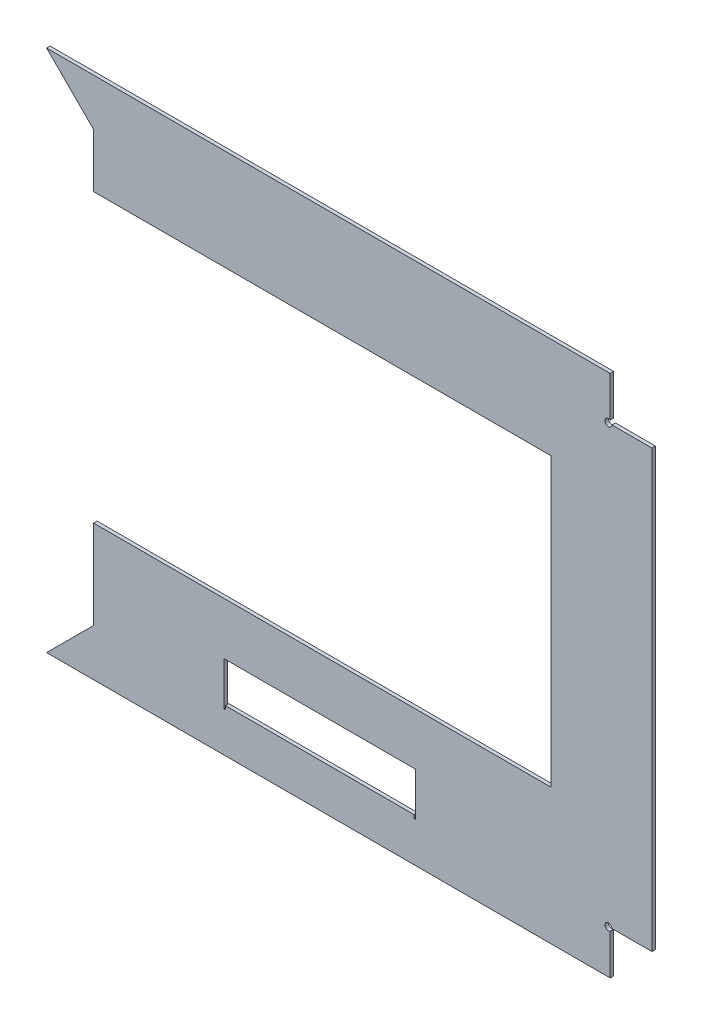
ISO-10303-21;
HEADER;
FILE_DESCRIPTION(('STEP AP214'),'2;1');
FILE_NAME('part.step','',(''),(''),'','','');
FILE_SCHEMA(('AUTOMOTIVE_DESIGN { 1 0 10303 214 1 1 1 1 }'));
ENDSEC;
DATA;
#1=APPLICATION_CONTEXT('core data for automotive mechanical design processes');
#2=APPLICATION_PROTOCOL_DEFINITION('international standard','automotive_design',2000,#1);
#3=PRODUCT_CONTEXT('',#1,'mechanical');
#4=PRODUCT('Part','Part','',(#3));
#5=PRODUCT_RELATED_PRODUCT_CATEGORY('part','',(#4));
#6=PRODUCT_DEFINITION_FORMATION('','',#4);
#7=PRODUCT_DEFINITION_CONTEXT('part definition',#1,'design');
#8=PRODUCT_DEFINITION('design','',#6,#7);
#9=PRODUCT_DEFINITION_SHAPE('','',#8);
#10=(LENGTH_UNIT() NAMED_UNIT(*) SI_UNIT(.MILLI.,.METRE.));
#11=(NAMED_UNIT(*) PLANE_ANGLE_UNIT() SI_UNIT($,.RADIAN.));
#12=(NAMED_UNIT(*) SI_UNIT($,.STERADIAN.) SOLID_ANGLE_UNIT());
#13=UNCERTAINTY_MEASURE_WITH_UNIT(LENGTH_MEASURE(1.E-05),#10,'distance_accuracy_value','');
#14=(GEOMETRIC_REPRESENTATION_CONTEXT(3) GLOBAL_UNCERTAINTY_ASSIGNED_CONTEXT((#13)) GLOBAL_UNIT_ASSIGNED_CONTEXT((#10,
#11,#12)) REPRESENTATION_CONTEXT('',''));
#15=CARTESIAN_POINT('',(0.,0.,0.));
#16=DIRECTION('',(0.,0.,1.));
#17=DIRECTION('',(1.,0.,0.));
#18=AXIS2_PLACEMENT_3D('',#15,#16,#17);
#19=CARTESIAN_POINT('',(649.998494896039,-105.7,2.22044604925031E-13));
#20=DIRECTION('',(0.,1.,0.));
#21=DIRECTION('',(-1.,0.,0.));
#22=AXIS2_PLACEMENT_3D('',#19,#20,#21);
#23=PLANE('',#22);
#24=DIRECTION('',(0.,0.,1.));
#25=VECTOR('',#24,1.);
#26=CARTESIAN_POINT('',(649.987283445268,-105.7,-4.01999999999969));
#27=LINE('',#26,#25);
#28=CARTESIAN_POINT('',(649.987283445268,-105.7,-3.99999999999985));
#29=VERTEX_POINT('',#28);
#30=CARTESIAN_POINT('',(649.987283445268,-105.7,1.50939503766362E-13));
#31=VERTEX_POINT('',#30);
#32=EDGE_CURVE('E383',#29,#31,#27,.T.);
#33=ORIENTED_EDGE('',*,*,#32,.F.);
#34=DIRECTION('',(1.,0.,0.));
#35=VECTOR('',#34,1.);
#36=CARTESIAN_POINT('',(649.998494896039,-105.7,-3.99999999999978));
#37=LINE('',#36,#35);
#38=CARTESIAN_POINT('',(695.99849489604,-105.7,-4.00000000000023));
#39=VERTEX_POINT('',#38);
#40=EDGE_CURVE('E382',#29,#39,#37,.T.);
#41=ORIENTED_EDGE('',*,*,#40,.T.);
#42=DIRECTION('',(0.,0.,-1.));
#43=VECTOR('',#42,1.);
#44=CARTESIAN_POINT('',(695.99849489604,-105.7,-2.22044604925031E-13));
#45=LINE('',#44,#43);
#46=CARTESIAN_POINT('',(695.99849489604,-105.7,-2.22044604925031E-13));
#47=VERTEX_POINT('',#46);
#48=EDGE_CURVE('E468',#47,#39,#45,.T.);
#49=ORIENTED_EDGE('',*,*,#48,.F.);
#50=DIRECTION('',(1.,0.,0.));
#51=VECTOR('',#50,1.);
#52=CARTESIAN_POINT('',(649.998494896039,-105.7,2.22044604925031E-13));
#53=LINE('',#52,#51);
#54=EDGE_CURVE('E200',#31,#47,#53,.T.);
#55=ORIENTED_EDGE('',*,*,#54,.F.);
#56=EDGE_LOOP('',(#33,#41,#49,#55));
#57=FACE_BOUND('',#56,.T.);
#58=ADVANCED_FACE('F196',(#57),#23,.F.);
#59=CARTESIAN_POINT('',(648.,-109.99849489604,-3.99999999999998));
#60=DIRECTION('',(-1.,0.,0.));
#61=DIRECTION('',(0.,-1.,0.));
#62=AXIS2_PLACEMENT_3D('',#59,#60,#61);
#63=PLANE('',#62);
#64=DIRECTION('',(0.,0.,1.));
#65=VECTOR('',#64,1.);
#66=CARTESIAN_POINT('',(648.,-109.46204535957,-4.01999999999969));
#67=LINE('',#66,#65);
#68=CARTESIAN_POINT('',(648.,-109.46204535957,0.));
#69=VERTEX_POINT('',#68);
#70=CARTESIAN_POINT('',(648.,-109.46204535957,-4.00000000000025));
#71=VERTEX_POINT('',#70);
#72=EDGE_CURVE('E14',#69,#71,#67,.F.);
#73=ORIENTED_EDGE('',*,*,#72,.F.);
#74=DIRECTION('',(0.,-1.,0.));
#75=VECTOR('',#74,1.);
#76=CARTESIAN_POINT('',(648.,-109.99849489604,0.));
#77=LINE('',#76,#75);
#78=CARTESIAN_POINT('',(648.,-155.99849489604,-2.4980018054066E-13));
#79=VERTEX_POINT('',#78);
#80=EDGE_CURVE('E399',#69,#79,#77,.T.);
#81=ORIENTED_EDGE('',*,*,#80,.T.);
#82=DIRECTION('',(0.,0.,1.));
#83=VECTOR('',#82,1.);
#84=CARTESIAN_POINT('',(648.,-155.99849489604,-4.00000000000025));
#85=LINE('',#84,#83);
#86=CARTESIAN_POINT('',(648.,-155.99849489604,-4.00000000000025));
#87=VERTEX_POINT('',#86);
#88=EDGE_CURVE('E388',#87,#79,#85,.T.);
#89=ORIENTED_EDGE('',*,*,#88,.F.);
#90=DIRECTION('',(0.,-1.,0.));
#91=VECTOR('',#90,1.);
#92=CARTESIAN_POINT('',(648.,-109.99849489604,-3.99999999999998));
#93=LINE('',#92,#91);
#94=EDGE_CURVE('E379',#71,#87,#93,.T.);
#95=ORIENTED_EDGE('',*,*,#94,.F.);
#96=EDGE_LOOP('',(#73,#81,#89,#95));
#97=FACE_BOUND('',#96,.T.);
#98=ADVANCED_FACE('F386',(#97),#63,.F.);
#99=CARTESIAN_POINT('',(649.99849489604,395.7,2.22044604925031E-13));
#100=DIRECTION('',(0.,1.,0.));
#101=DIRECTION('',(1.,0.,0.));
#102=AXIS2_PLACEMENT_3D('',#99,#100,#101);
#103=PLANE('',#102);
#104=DIRECTION('',(1.,0.,0.));
#105=VECTOR('',#104,1.);
#106=CARTESIAN_POINT('',(649.99849489604,395.7,-3.99999999999978));
#107=LINE('',#106,#105);
#108=CARTESIAN_POINT('',(649.987283445268,395.7,-3.99999999999985));
#109=VERTEX_POINT('',#108);
#110=CARTESIAN_POINT('',(695.998494896039,395.7,-4.00000000000011));
#111=VERTEX_POINT('',#110);
#112=EDGE_CURVE('E466',#109,#111,#107,.T.);
#113=ORIENTED_EDGE('',*,*,#112,.F.);
#114=DIRECTION('',(0.,0.,1.));
#115=VECTOR('',#114,1.);
#116=CARTESIAN_POINT('',(649.987283445268,395.7,-4.01999999999984));
#117=LINE('',#116,#115);
#118=CARTESIAN_POINT('',(649.987283445268,395.7,1.51535528106944E-13));
#119=VERTEX_POINT('',#118);
#120=EDGE_CURVE('E557',#109,#119,#117,.T.);
#121=ORIENTED_EDGE('',*,*,#120,.T.);
#122=DIRECTION('',(1.,0.,0.));
#123=VECTOR('',#122,1.);
#124=CARTESIAN_POINT('',(649.99849489604,395.7,2.22044604925031E-13));
#125=LINE('',#124,#123);
#126=CARTESIAN_POINT('',(695.99849489604,395.7,-1.11022302462516E-13));
#127=VERTEX_POINT('',#126);
#128=EDGE_CURVE('E456',#119,#127,#125,.T.);
#129=ORIENTED_EDGE('',*,*,#128,.T.);
#130=DIRECTION('',(0.,0.,-1.));
#131=VECTOR('',#130,1.);
#132=CARTESIAN_POINT('',(695.99849489604,395.7,-1.11022302462516E-13));
#133=LINE('',#132,#131);
#134=EDGE_CURVE('E450',#127,#111,#133,.T.);
#135=ORIENTED_EDGE('',*,*,#134,.T.);
#136=EDGE_LOOP('',(#113,#121,#129,#135));
#137=FACE_BOUND('',#136,.T.);
#138=ADVANCED_FACE('F642',(#137),#103,.T.);
#139=CARTESIAN_POINT('',(648.,399.99849489604,-3.99999999999984));
#140=DIRECTION('',(1.,0.,0.));
#141=DIRECTION('',(0.,-1.,0.));
#142=AXIS2_PLACEMENT_3D('',#139,#140,#141);
#143=PLANE('',#142);
#144=DIRECTION('',(0.,1.,0.));
#145=VECTOR('',#144,1.);
#146=CARTESIAN_POINT('',(648.,399.99849489604,1.66533453693773E-13));
#147=LINE('',#146,#145);
#148=CARTESIAN_POINT('',(648.,399.46204535957,1.64798730217797E-13));
#149=VERTEX_POINT('',#148);
#150=CARTESIAN_POINT('',(648.,445.99849489604,-2.22044604925031E-13));
#151=VERTEX_POINT('',#150);
#152=EDGE_CURVE('E533',#149,#151,#147,.T.);
#153=ORIENTED_EDGE('',*,*,#152,.F.);
#154=DIRECTION('',(0.,0.,1.));
#155=VECTOR('',#154,1.);
#156=CARTESIAN_POINT('',(648.,399.46204535957,-4.01999999999984));
#157=LINE('',#156,#155);
#158=CARTESIAN_POINT('',(648.,399.46204535957,-3.99999999999983));
#159=VERTEX_POINT('',#158);
#160=EDGE_CURVE('E206',#149,#159,#157,.F.);
#161=ORIENTED_EDGE('',*,*,#160,.T.);
#162=DIRECTION('',(0.,1.,0.));
#163=VECTOR('',#162,1.);
#164=CARTESIAN_POINT('',(648.,399.99849489604,-3.99999999999984));
#165=LINE('',#164,#163);
#166=CARTESIAN_POINT('',(648.,445.99849489604,-4.00000000000023));
#167=VERTEX_POINT('',#166);
#168=EDGE_CURVE('E535',#159,#167,#165,.T.);
#169=ORIENTED_EDGE('',*,*,#168,.T.);
#170=DIRECTION('',(0.,0.,1.));
#171=VECTOR('',#170,1.);
#172=CARTESIAN_POINT('',(648.,445.99849489604,-4.00000000000023));
#173=LINE('',#172,#171);
#174=EDGE_CURVE('E563',#167,#151,#173,.T.);
#175=ORIENTED_EDGE('',*,*,#174,.T.);
#176=EDGE_LOOP('',(#153,#161,#169,#175));
#177=FACE_BOUND('',#176,.T.);
#178=ADVANCED_FACE('F647',(#177),#143,.T.);
#179=CARTESIAN_POINT('',(424.000000000004,-59.9999999999999,4.00000000000018));
#180=DIRECTION('',(1.,0.,0.));
#181=DIRECTION('',(0.,0.,-1.));
#182=AXIS2_PLACEMENT_3D('',#179,#180,#181);
#183=PLANE('',#182);
#184=DIRECTION('',(0.,-1.,0.));
#185=VECTOR('',#184,1.);
#186=CARTESIAN_POINT('',(424.000000000004,-59.9999999999999,-3.99999999999982));
#187=LINE('',#186,#185);
#188=CARTESIAN_POINT('',(424.000000000004,-59.9999999999999,-3.99999999999982));
#189=VERTEX_POINT('',#188);
#190=CARTESIAN_POINT('',(424.000000000004,-109.99849489604,-3.99999999999991));
#191=VERTEX_POINT('',#190);
#192=EDGE_CURVE('E445',#189,#191,#187,.T.);
#193=ORIENTED_EDGE('',*,*,#192,.T.);
#194=DIRECTION('',(0.,0.,-1.));
#195=VECTOR('',#194,1.);
#196=CARTESIAN_POINT('',(424.000000000004,-109.99849489604,46.0000000000002));
#197=LINE('',#196,#195);
#198=CARTESIAN_POINT('',(424.000000000004,-109.99849489604,0.));
#199=VERTEX_POINT('',#198);
#200=EDGE_CURVE('E441',#199,#191,#197,.T.);
#201=ORIENTED_EDGE('',*,*,#200,.F.);
#202=DIRECTION('',(0.,-1.,0.));
#203=VECTOR('',#202,1.);
#204=CARTESIAN_POINT('',(424.000000000004,0.,1.80411241501588E-13));
#205=LINE('',#204,#203);
#206=CARTESIAN_POINT('',(424.000000000004,-59.9999999999999,1.80411241501588E-13));
#207=VERTEX_POINT('',#206);
#208=EDGE_CURVE('E487',#207,#199,#205,.T.);
#209=ORIENTED_EDGE('',*,*,#208,.F.);
#210=DIRECTION('',(0.,0.,-1.));
#211=VECTOR('',#210,1.);
#212=CARTESIAN_POINT('',(424.000000000004,-59.9999999999999,4.00000000000018));
#213=LINE('',#212,#211);
#214=EDGE_CURVE('E481',#207,#189,#213,.T.);
#215=ORIENTED_EDGE('',*,*,#214,.T.);
#216=EDGE_LOOP('',(#193,#201,#209,#215));
#217=FACE_BOUND('',#216,.T.);
#218=ADVANCED_FACE('F620',(#217),#183,.F.);
#219=CARTESIAN_POINT('',(0.,0.,-3.99999999999982));
#220=DIRECTION('',(0.,0.,-1.));
#221=DIRECTION('',(-1.,0.,0.));
#222=AXIS2_PLACEMENT_3D('',#219,#220,#221);
#223=PLANE('',#222);
#224=DIRECTION('',(-1.,0.,0.));
#225=VECTOR('',#224,1.);
#226=CARTESIAN_POINT('',(424.000000000004,-109.99849489604,-3.99999999999984));
#227=LINE('',#226,#225);
#228=CARTESIAN_POINT('',(422.500000000004,-109.99849489604,-3.99999999999984));
#229=VERTEX_POINT('',#228);
#230=EDGE_CURVE('E569',#191,#229,#227,.T.);
#231=ORIENTED_EDGE('',*,*,#230,.F.);
#232=ORIENTED_EDGE('',*,*,#192,.F.);
#233=DIRECTION('',(1.,0.,0.));
#234=VECTOR('',#233,1.);
#235=CARTESIAN_POINT('',(424.000000000004,-59.9999999999999,-3.99999999999982));
#236=LINE('',#235,#234);
#237=CARTESIAN_POINT('',(204.000000000004,-59.9999999999999,-3.99999999999982));
#238=VERTEX_POINT('',#237);
#239=EDGE_CURVE('E477',#238,#189,#236,.T.);
#240=ORIENTED_EDGE('',*,*,#239,.F.);
#241=DIRECTION('',(0.,1.,0.));
#242=VECTOR('',#241,1.);
#243=CARTESIAN_POINT('',(204.000000000004,-59.9999999999999,-3.99999999999982));
#244=LINE('',#243,#242);
#245=CARTESIAN_POINT('',(204.000000000004,-109.99849489604,-3.99999999999988));
#246=VERTEX_POINT('',#245);
#247=EDGE_CURVE('E448',#246,#238,#244,.T.);
#248=ORIENTED_EDGE('',*,*,#247,.F.);
#249=CARTESIAN_POINT('',(205.500000000004,-109.99849489604,-3.99999999999984));
#250=VERTEX_POINT('',#249);
#251=EDGE_CURVE('E574',#250,#246,#227,.T.);
#252=ORIENTED_EDGE('',*,*,#251,.F.);
#253=DIRECTION('',(0.,-1.,0.));
#254=VECTOR('',#253,1.);
#255=CARTESIAN_POINT('',(205.500000000004,-105.99849489604,-3.99999999999989));
#256=LINE('',#255,#254);
#257=CARTESIAN_POINT('',(205.500000000004,-105.99849489604,-3.99999999999989));
#258=VERTEX_POINT('',#257);
#259=EDGE_CURVE('E406',#258,#250,#256,.T.);
#260=ORIENTED_EDGE('',*,*,#259,.F.);
#261=DIRECTION('',(-1.,0.,0.));
#262=VECTOR('',#261,1.);
#263=CARTESIAN_POINT('',(422.500000000004,-105.99849489604,-3.99999999999989));
#264=LINE('',#263,#262);
#265=CARTESIAN_POINT('',(422.500000000004,-105.99849489604,-3.99999999999989));
#266=VERTEX_POINT('',#265);
#267=EDGE_CURVE('E416',#266,#258,#264,.T.);
#268=ORIENTED_EDGE('',*,*,#267,.F.);
#269=DIRECTION('',(0.,-1.,0.));
#270=VECTOR('',#269,1.);
#271=CARTESIAN_POINT('',(422.500000000004,-105.99849489604,-3.99999999999989));
#272=LINE('',#271,#270);
#273=EDGE_CURVE('E390',#266,#229,#272,.T.);
#274=ORIENTED_EDGE('',*,*,#273,.T.);
#275=EDGE_LOOP('',(#231,#232,#240,#248,#252,#260,#268,#274));
#276=FACE_BOUND('',#275,.T.);
#277=ORIENTED_EDGE('',*,*,#40,.F.);
#278=CARTESIAN_POINT('',(645.99924744802,-105.99924744802,-3.99999999999982));
#279=DIRECTION('',(0.,0.,-1.));
#280=DIRECTION('',(-1.,0.,0.));
#281=AXIS2_PLACEMENT_3D('',#278,#279,#280);
#282=CIRCLE('',#281,3.99924744801982);
#283=EDGE_CURVE('E370',#29,#71,#282,.F.);
#284=ORIENTED_EDGE('',*,*,#283,.T.);
#285=ORIENTED_EDGE('',*,*,#94,.T.);
#286=DIRECTION('',(-1.,0.,0.));
#287=VECTOR('',#286,1.);
#288=CARTESIAN_POINT('',(0.,-155.99849489604,-4.00000000000036));
#289=LINE('',#288,#287);
#290=CARTESIAN_POINT('',(0.,-155.998494896044,-4.00000000000036));
#291=VERTEX_POINT('',#290);
#292=EDGE_CURVE('E389',#87,#291,#289,.T.);
#293=ORIENTED_EDGE('',*,*,#292,.T.);
#294=DIRECTION('',(0.707106781186544,0.707106781186551,0.));
#295=VECTOR('',#294,1.);
#296=CARTESIAN_POINT('',(25.0000000000024,-130.998494896041,-4.00000000000013));
#297=LINE('',#296,#295);
#298=CARTESIAN_POINT('',(46.0000000000038,-109.99849489604,-3.99999999999998));
#299=VERTEX_POINT('',#298);
#300=EDGE_CURVE('E395',#291,#299,#297,.T.);
#301=ORIENTED_EDGE('',*,*,#300,.T.);
#302=DIRECTION('',(0.707173301140883,0.707040254973864,0.));
#303=VECTOR('',#302,1.);
#304=CARTESIAN_POINT('',(46.0000000000036,-109.99849489604,-3.99999999999988));
#305=LINE('',#304,#303);
#306=CARTESIAN_POINT('',(54.0000000000037,-102.,-3.99999999999988));
#307=VERTEX_POINT('',#306);
#308=EDGE_CURVE('E435',#299,#307,#305,.T.);
#309=ORIENTED_EDGE('',*,*,#308,.T.);
#310=DIRECTION('',(0.,1.,0.));
#311=VECTOR('',#310,1.);
#312=CARTESIAN_POINT('',(53.9999999999994,-110.010025,-3.99999999999568));
#313=LINE('',#312,#311);
#314=CARTESIAN_POINT('',(53.9999999999994,0.,-3.99999999999605));
#315=VERTEX_POINT('',#314);
#316=EDGE_CURVE('E494',#307,#315,#313,.T.);
#317=ORIENTED_EDGE('',*,*,#316,.T.);
#318=DIRECTION('',(-1.,0.,0.));
#319=VECTOR('',#318,1.);
#320=CARTESIAN_POINT('',(0.,0.,-3.99999999999982));
#321=LINE('',#320,#319);
#322=CARTESIAN_POINT('',(580.,0.,-3.99999999999982));
#323=VERTEX_POINT('',#322);
#324=EDGE_CURVE('E510',#323,#315,#321,.T.);
#325=ORIENTED_EDGE('',*,*,#324,.F.);
#326=DIRECTION('',(0.,-1.,0.));
#327=VECTOR('',#326,1.);
#328=CARTESIAN_POINT('',(580.,0.,-3.99999999999982));
#329=LINE('',#328,#327);
#330=CARTESIAN_POINT('',(580.,330.,-3.99999999999982));
#331=VERTEX_POINT('',#330);
#332=EDGE_CURVE('E506',#331,#323,#329,.T.);
#333=ORIENTED_EDGE('',*,*,#332,.F.);
#334=DIRECTION('',(1.,0.,0.));
#335=VECTOR('',#334,1.);
#336=CARTESIAN_POINT('',(580.,330.,-3.99999999999982));
#337=LINE('',#336,#335);
#338=CARTESIAN_POINT('',(53.9999999999994,330.,-3.99999999999715));
#339=VERTEX_POINT('',#338);
#340=EDGE_CURVE('E504',#339,#331,#337,.T.);
#341=ORIENTED_EDGE('',*,*,#340,.F.);
#342=DIRECTION('',(0.,1.,0.));
#343=VECTOR('',#342,1.);
#344=CARTESIAN_POINT('',(53.9999999999994,-110.010025,-3.99999999999568));
#345=LINE('',#344,#343);
#346=CARTESIAN_POINT('',(54.0000000000017,392.,-3.9999999999998));
#347=VERTEX_POINT('',#346);
#348=EDGE_CURVE('E492',#339,#347,#345,.T.);
#349=ORIENTED_EDGE('',*,*,#348,.T.);
#350=DIRECTION('',(-0.707173301140879,0.707040254973868,0.));
#351=VECTOR('',#350,1.);
#352=CARTESIAN_POINT('',(54.0000000000017,392.,-3.99999999999984));
#353=LINE('',#352,#351);
#354=CARTESIAN_POINT('',(46.0000000000019,399.99849489604,-3.99999999999984));
#355=VERTEX_POINT('',#354);
#356=EDGE_CURVE('E434',#347,#355,#353,.T.);
#357=ORIENTED_EDGE('',*,*,#356,.T.);
#358=DIRECTION('',(0.707106781186544,-0.707106781186551,0.));
#359=VECTOR('',#358,1.);
#360=CARTESIAN_POINT('',(0.,445.998494896042,-4.00000000000017));
#361=LINE('',#360,#359);
#362=CARTESIAN_POINT('',(0.,445.998494896042,-4.00000000000017));
#363=VERTEX_POINT('',#362);
#364=EDGE_CURVE('E546',#363,#355,#361,.T.);
#365=ORIENTED_EDGE('',*,*,#364,.F.);
#366=DIRECTION('',(1.,0.,0.));
#367=VECTOR('',#366,1.);
#368=CARTESIAN_POINT('',(0.,445.99849489604,-4.00000000000023));
#369=LINE('',#368,#367);
#370=EDGE_CURVE('E548',#363,#167,#369,.T.);
#371=ORIENTED_EDGE('',*,*,#370,.T.);
#372=ORIENTED_EDGE('',*,*,#168,.F.);
#373=CARTESIAN_POINT('',(645.99924744802,395.99924744802,-3.99999999999982));
#374=DIRECTION('',(0.,0.,-1.));
#375=DIRECTION('',(-1.,0.,0.));
#376=AXIS2_PLACEMENT_3D('',#373,#374,#375);
#377=CIRCLE('',#376,3.99924744801982);
#378=EDGE_CURVE('E221',#159,#109,#377,.F.);
#379=ORIENTED_EDGE('',*,*,#378,.T.);
#380=ORIENTED_EDGE('',*,*,#112,.T.);
#381=DIRECTION('',(0.,-1.,0.));
#382=VECTOR('',#381,1.);
#383=CARTESIAN_POINT('',(695.99849489604,0.,-4.));
#384=LINE('',#383,#382);
#385=EDGE_CURVE('E460',#111,#39,#384,.T.);
#386=ORIENTED_EDGE('',*,*,#385,.T.);
#387=EDGE_LOOP('',(#277,#284,#285,#293,#301,#309,#317,#325,#333,#341,#349,#357,#365,#371,#372,
#379,#380,#386));
#388=FACE_BOUND('',#387,.T.);
#389=ADVANCED_FACE('F377',(#276,#388),#223,.T.);
#390=CARTESIAN_POINT('',(0.,0.,1.80411241501588E-13));
#391=DIRECTION('',(0.,0.,-1.));
#392=DIRECTION('',(-1.,0.,0.));
#393=AXIS2_PLACEMENT_3D('',#390,#391,#392);
#394=PLANE('',#393);
#395=CARTESIAN_POINT('',(645.99924744802,-105.99924744802,1.80411241501588E-13));
#396=DIRECTION('',(0.,0.,-1.));
#397=DIRECTION('',(-1.,0.,0.));
#398=AXIS2_PLACEMENT_3D('',#395,#396,#397);
#399=CIRCLE('',#398,3.99924744801982);
#400=EDGE_CURVE('E213',#31,#69,#399,.F.);
#401=ORIENTED_EDGE('',*,*,#400,.F.);
#402=ORIENTED_EDGE('',*,*,#54,.T.);
#403=DIRECTION('',(0.,1.,0.));
#404=VECTOR('',#403,1.);
#405=CARTESIAN_POINT('',(695.99849489604,-110.,-1.11022302462516E-13));
#406=LINE('',#405,#404);
#407=EDGE_CURVE('E438',#127,#47,#406,.F.);
#408=ORIENTED_EDGE('',*,*,#407,.F.);
#409=ORIENTED_EDGE('',*,*,#128,.F.);
#410=CARTESIAN_POINT('',(645.99924744802,395.99924744802,1.80411241501588E-13));
#411=DIRECTION('',(0.,0.,-1.));
#412=DIRECTION('',(-1.,0.,0.));
#413=AXIS2_PLACEMENT_3D('',#410,#411,#412);
#414=CIRCLE('',#413,3.99924744801982);
#415=EDGE_CURVE('E987',#149,#119,#414,.F.);
#416=ORIENTED_EDGE('',*,*,#415,.F.);
#417=ORIENTED_EDGE('',*,*,#152,.T.);
#418=DIRECTION('',(-1.,0.,0.));
#419=VECTOR('',#418,1.);
#420=CARTESIAN_POINT('',(650.,445.99849489604,-2.22044604925031E-13));
#421=LINE('',#420,#419);
#422=CARTESIAN_POINT('',(0.,445.998494896042,-1.66533453693773E-13));
#423=VERTEX_POINT('',#422);
#424=EDGE_CURVE('E554',#423,#151,#421,.F.);
#425=ORIENTED_EDGE('',*,*,#424,.F.);
#426=DIRECTION('',(0.707106781186544,-0.707106781186551,0.));
#427=VECTOR('',#426,1.);
#428=CARTESIAN_POINT('',(0.,445.998494896042,-1.66533453693773E-13));
#429=LINE('',#428,#427);
#430=CARTESIAN_POINT('',(46.0000000000019,399.99849489604,1.66533453693773E-13));
#431=VERTEX_POINT('',#430);
#432=EDGE_CURVE('E536',#423,#431,#429,.T.);
#433=ORIENTED_EDGE('',*,*,#432,.T.);
#434=DIRECTION('',(-0.707173301140879,0.707040254973868,0.));
#435=VECTOR('',#434,1.);
#436=CARTESIAN_POINT('',(54.0000000000017,392.,1.6306400674182E-13));
#437=LINE('',#436,#435);
#438=CARTESIAN_POINT('',(54.0000000000018,392.,1.66533453693773E-13));
#439=VERTEX_POINT('',#438);
#440=EDGE_CURVE('E560',#439,#431,#437,.T.);
#441=ORIENTED_EDGE('',*,*,#440,.F.);
#442=DIRECTION('',(0.,1.,0.));
#443=VECTOR('',#442,1.);
#444=CARTESIAN_POINT('',(53.9999999999994,0.,1.76941794549634E-13));
#445=LINE('',#444,#443);
#446=CARTESIAN_POINT('',(53.9999999999994,330.,1.76941794549634E-13));
#447=VERTEX_POINT('',#446);
#448=EDGE_CURVE('E491',#447,#439,#445,.T.);
#449=ORIENTED_EDGE('',*,*,#448,.F.);
#450=DIRECTION('',(1.,0.,0.));
#451=VECTOR('',#450,1.);
#452=CARTESIAN_POINT('',(580.,330.,1.80411241501588E-13));
#453=LINE('',#452,#451);
#454=CARTESIAN_POINT('',(580.,330.,1.80411241501588E-13));
#455=VERTEX_POINT('',#454);
#456=EDGE_CURVE('E503',#447,#455,#453,.T.);
#457=ORIENTED_EDGE('',*,*,#456,.T.);
#458=DIRECTION('',(0.,-1.,0.));
#459=VECTOR('',#458,1.);
#460=CARTESIAN_POINT('',(580.,0.,1.80411241501588E-13));
#461=LINE('',#460,#459);
#462=CARTESIAN_POINT('',(580.,0.,1.80411241501588E-13));
#463=VERTEX_POINT('',#462);
#464=EDGE_CURVE('E515',#455,#463,#461,.T.);
#465=ORIENTED_EDGE('',*,*,#464,.T.);
#466=DIRECTION('',(-1.,0.,0.));
#467=VECTOR('',#466,1.);
#468=CARTESIAN_POINT('',(0.,0.,1.80411241501588E-13));
#469=LINE('',#468,#467);
#470=CARTESIAN_POINT('',(53.9999999999994,0.,1.76941794549634E-13));
#471=VERTEX_POINT('',#470);
#472=EDGE_CURVE('E507',#463,#471,#469,.T.);
#473=ORIENTED_EDGE('',*,*,#472,.T.);
#474=DIRECTION('',(0.,1.,0.));
#475=VECTOR('',#474,1.);
#476=CARTESIAN_POINT('',(54.0000000000037,0.,1.76941794549634E-13));
#477=LINE('',#476,#475);
#478=CARTESIAN_POINT('',(54.0000000000037,-102.,0.));
#479=VERTEX_POINT('',#478);
#480=EDGE_CURVE('E496',#479,#471,#477,.T.);
#481=ORIENTED_EDGE('',*,*,#480,.F.);
#482=DIRECTION('',(0.707173301140883,0.707040254973864,0.));
#483=VECTOR('',#482,1.);
#484=CARTESIAN_POINT('',(46.0000000000036,-109.99849489604,1.21430643318376E-13));
#485=LINE('',#484,#483);
#486=CARTESIAN_POINT('',(46.0000000000038,-109.99849489604,0.));
#487=VERTEX_POINT('',#486);
#488=EDGE_CURVE('E439',#487,#479,#485,.T.);
#489=ORIENTED_EDGE('',*,*,#488,.F.);
#490=DIRECTION('',(0.707106781186544,0.707106781186551,0.));
#491=VECTOR('',#490,1.);
#492=CARTESIAN_POINT('',(25.0000000000024,-130.998494896041,-1.2490009027033E-13));
#493=LINE('',#492,#491);
#494=CARTESIAN_POINT('',(0.,-155.998494896044,-3.19189119579733E-13));
#495=VERTEX_POINT('',#494);
#496=EDGE_CURVE('E583',#495,#487,#493,.T.);
#497=ORIENTED_EDGE('',*,*,#496,.F.);
#498=DIRECTION('',(1.,0.,0.));
#499=VECTOR('',#498,1.);
#500=CARTESIAN_POINT('',(0.,-155.99849489604,-3.60822483003176E-13));
#501=LINE('',#500,#499);
#502=EDGE_CURVE('E427',#79,#495,#501,.F.);
#503=ORIENTED_EDGE('',*,*,#502,.F.);
#504=ORIENTED_EDGE('',*,*,#80,.F.);
#505=EDGE_LOOP('',(#401,#402,#408,#409,#416,#417,#425,#433,#441,#449,#457,#465,#473,#481,#489,
#497,#503,#504));
#506=FACE_BOUND('',#505,.T.);
#507=DIRECTION('',(1.,0.,0.));
#508=VECTOR('',#507,1.);
#509=CARTESIAN_POINT('',(0.,-59.9999999999999,1.80411241501588E-13));
#510=LINE('',#509,#508);
#511=CARTESIAN_POINT('',(204.000000000004,-59.9999999999999,1.80411241501588E-13));
#512=VERTEX_POINT('',#511);
#513=EDGE_CURVE('E522',#512,#207,#510,.T.);
#514=ORIENTED_EDGE('',*,*,#513,.T.);
#515=ORIENTED_EDGE('',*,*,#208,.T.);
#516=DIRECTION('',(1.,0.,0.));
#517=VECTOR('',#516,1.);
#518=CARTESIAN_POINT('',(0.,-109.99849489604,0.));
#519=LINE('',#518,#517);
#520=CARTESIAN_POINT('',(422.500000000004,-109.99849489604,0.));
#521=VERTEX_POINT('',#520);
#522=EDGE_CURVE('E566',#521,#199,#519,.T.);
#523=ORIENTED_EDGE('',*,*,#522,.F.);
#524=DIRECTION('',(0.,-1.,0.));
#525=VECTOR('',#524,1.);
#526=CARTESIAN_POINT('',(422.500000000004,-105.99849489604,0.));
#527=LINE('',#526,#525);
#528=CARTESIAN_POINT('',(422.500000000004,-105.99849489604,0.));
#529=VERTEX_POINT('',#528);
#530=EDGE_CURVE('E421',#529,#521,#527,.T.);
#531=ORIENTED_EDGE('',*,*,#530,.F.);
#532=DIRECTION('',(1.,0.,0.));
#533=VECTOR('',#532,1.);
#534=CARTESIAN_POINT('',(422.500000000004,-105.99849489604,0.));
#535=LINE('',#534,#533);
#536=CARTESIAN_POINT('',(205.500000000004,-105.99849489604,1.66533453693773E-13));
#537=VERTEX_POINT('',#536);
#538=EDGE_CURVE('E412',#537,#529,#535,.T.);
#539=ORIENTED_EDGE('',*,*,#538,.F.);
#540=DIRECTION('',(0.,-1.,0.));
#541=VECTOR('',#540,1.);
#542=CARTESIAN_POINT('',(205.500000000004,-105.99849489604,1.66533453693773E-13));
#543=LINE('',#542,#541);
#544=CARTESIAN_POINT('',(205.500000000004,-109.99849489604,0.));
#545=VERTEX_POINT('',#544);
#546=EDGE_CURVE('E578',#537,#545,#543,.T.);
#547=ORIENTED_EDGE('',*,*,#546,.T.);
#548=CARTESIAN_POINT('',(204.000000000004,-109.99849489604,0.));
#549=VERTEX_POINT('',#548);
#550=EDGE_CURVE('E392',#549,#545,#519,.T.);
#551=ORIENTED_EDGE('',*,*,#550,.F.);
#552=DIRECTION('',(0.,1.,0.));
#553=VECTOR('',#552,1.);
#554=CARTESIAN_POINT('',(204.000000000004,0.,1.80411241501588E-13));
#555=LINE('',#554,#553);
#556=EDGE_CURVE('E483',#549,#512,#555,.T.);
#557=ORIENTED_EDGE('',*,*,#556,.T.);
#558=EDGE_LOOP('',(#514,#515,#523,#531,#539,#547,#551,#557));
#559=FACE_BOUND('',#558,.T.);
#560=ADVANCED_FACE('F198',(#506,#559),#394,.F.);
#561=CARTESIAN_POINT('',(580.,330.,-3.99999999999982));
#562=DIRECTION('',(0.,-1.,0.));
#563=DIRECTION('',(1.,0.,0.));
#564=AXIS2_PLACEMENT_3D('',#561,#562,#563);
#565=PLANE('',#564);
#566=ORIENTED_EDGE('',*,*,#456,.F.);
#567=DIRECTION('',(0.,0.,-1.));
#568=VECTOR('',#567,1.);
#569=CARTESIAN_POINT('',(53.9999999999994,330.,-3.99999999999715));
#570=LINE('',#569,#568);
#571=EDGE_CURVE('E489',#339,#447,#570,.F.);
#572=ORIENTED_EDGE('',*,*,#571,.F.);
#573=ORIENTED_EDGE('',*,*,#340,.T.);
#574=DIRECTION('',(0.,0.,1.));
#575=VECTOR('',#574,1.);
#576=CARTESIAN_POINT('',(580.,330.,-3.99999999999982));
#577=LINE('',#576,#575);
#578=EDGE_CURVE('E513',#331,#455,#577,.T.);
#579=ORIENTED_EDGE('',*,*,#578,.T.);
#580=EDGE_LOOP('',(#566,#572,#573,#579));
#581=FACE_BOUND('',#580,.T.);
#582=ADVANCED_FACE('F797',(#581),#565,.T.);
#583=CARTESIAN_POINT('',(0.,0.,-3.99999999999982));
#584=DIRECTION('',(0.,1.,0.));
#585=DIRECTION('',(0.,0.,1.));
#586=AXIS2_PLACEMENT_3D('',#583,#584,#585);
#587=PLANE('',#586);
#588=ORIENTED_EDGE('',*,*,#324,.T.);
#589=DIRECTION('',(0.,0.,-1.));
#590=VECTOR('',#589,1.);
#591=CARTESIAN_POINT('',(53.9999999999994,0.,-3.99999999999605));
#592=LINE('',#591,#590);
#593=EDGE_CURVE('E498',#315,#471,#592,.F.);
#594=ORIENTED_EDGE('',*,*,#593,.T.);
#595=ORIENTED_EDGE('',*,*,#472,.F.);
#596=DIRECTION('',(0.,0.,1.));
#597=VECTOR('',#596,1.);
#598=CARTESIAN_POINT('',(580.,0.,-3.99999999999982));
#599=LINE('',#598,#597);
#600=EDGE_CURVE('E520',#323,#463,#599,.T.);
#601=ORIENTED_EDGE('',*,*,#600,.F.);
#602=EDGE_LOOP('',(#588,#594,#595,#601));
#603=FACE_BOUND('',#602,.T.);
#604=ADVANCED_FACE('F785',(#603),#587,.T.);
#605=CARTESIAN_POINT('',(580.,0.,-3.99999999999982));
#606=DIRECTION('',(-1.,0.,0.));
#607=DIRECTION('',(0.,-1.,0.));
#608=AXIS2_PLACEMENT_3D('',#605,#606,#607);
#609=PLANE('',#608);
#610=ORIENTED_EDGE('',*,*,#464,.F.);
#611=ORIENTED_EDGE('',*,*,#578,.F.);
#612=ORIENTED_EDGE('',*,*,#332,.T.);
#613=ORIENTED_EDGE('',*,*,#600,.T.);
#614=EDGE_LOOP('',(#610,#611,#612,#613));
#615=FACE_BOUND('',#614,.T.);
#616=ADVANCED_FACE('F773',(#615),#609,.T.);
#617=CARTESIAN_POINT('',(53.9999999999994,-110.010025,-3.99999999999568));
#618=DIRECTION('',(-1.,0.,0.));
#619=DIRECTION('',(0.,1.,0.));
#620=AXIS2_PLACEMENT_3D('',#617,#618,#619);
#621=PLANE('',#620);
#622=ORIENTED_EDGE('',*,*,#316,.F.);
#623=DIRECTION('',(0.,0.,1.));
#624=VECTOR('',#623,1.);
#625=CARTESIAN_POINT('',(54.0000000000037,-102.,-3.99999999999997));
#626=LINE('',#625,#624);
#627=EDGE_CURVE('E527',#307,#479,#626,.T.);
#628=ORIENTED_EDGE('',*,*,#627,.T.);
#629=ORIENTED_EDGE('',*,*,#480,.T.);
#630=ORIENTED_EDGE('',*,*,#593,.F.);
#631=EDGE_LOOP('',(#622,#628,#629,#630));
#632=FACE_BOUND('',#631,.T.);
#633=ADVANCED_FACE('F634',(#632),#621,.T.);
#634=CARTESIAN_POINT('',(53.9999999999994,-110.010025,-3.99999999999568));
#635=DIRECTION('',(-1.,0.,0.));
#636=DIRECTION('',(0.,1.,0.));
#637=AXIS2_PLACEMENT_3D('',#634,#635,#636);
#638=PLANE('',#637);
#639=ORIENTED_EDGE('',*,*,#348,.F.);
#640=ORIENTED_EDGE('',*,*,#571,.T.);
#641=ORIENTED_EDGE('',*,*,#448,.T.);
#642=DIRECTION('',(0.,0.,1.));
#643=VECTOR('',#642,1.);
#644=CARTESIAN_POINT('',(54.0000000000017,392.,-3.9999999999998));
#645=LINE('',#644,#643);
#646=EDGE_CURVE('E530',#347,#439,#645,.T.);
#647=ORIENTED_EDGE('',*,*,#646,.F.);
#648=EDGE_LOOP('',(#639,#640,#641,#647));
#649=FACE_BOUND('',#648,.T.);
#650=ADVANCED_FACE('F626',(#649),#638,.T.);
#651=CARTESIAN_POINT('',(424.000000000004,-59.9999999999999,4.00000000000018));
#652=DIRECTION('',(0.,1.,0.));
#653=DIRECTION('',(0.,0.,1.));
#654=AXIS2_PLACEMENT_3D('',#651,#652,#653);
#655=PLANE('',#654);
#656=DIRECTION('',(0.,0.,-1.));
#657=VECTOR('',#656,1.);
#658=CARTESIAN_POINT('',(204.000000000004,-59.9999999999999,4.00000000000018));
#659=LINE('',#658,#657);
#660=EDGE_CURVE('E480',#512,#238,#659,.T.);
#661=ORIENTED_EDGE('',*,*,#660,.T.);
#662=ORIENTED_EDGE('',*,*,#239,.T.);
#663=ORIENTED_EDGE('',*,*,#214,.F.);
#664=ORIENTED_EDGE('',*,*,#513,.F.);
#665=EDGE_LOOP('',(#661,#662,#663,#664));
#666=FACE_BOUND('',#665,.T.);
#667=ADVANCED_FACE('F624',(#666),#655,.F.);
#668=CARTESIAN_POINT('',(204.000000000004,-59.9999999999999,4.00000000000018));
#669=DIRECTION('',(-1.,0.,0.));
#670=DIRECTION('',(0.,0.,1.));
#671=AXIS2_PLACEMENT_3D('',#668,#669,#670);
#672=PLANE('',#671);
#673=ORIENTED_EDGE('',*,*,#556,.F.);
#674=DIRECTION('',(0.,0.,1.));
#675=VECTOR('',#674,1.);
#676=CARTESIAN_POINT('',(204.000000000004,-109.99849489604,46.0000000000002));
#677=LINE('',#676,#675);
#678=EDGE_CURVE('E575',#246,#549,#677,.T.);
#679=ORIENTED_EDGE('',*,*,#678,.F.);
#680=ORIENTED_EDGE('',*,*,#247,.T.);
#681=ORIENTED_EDGE('',*,*,#660,.F.);
#682=EDGE_LOOP('',(#673,#679,#680,#681));
#683=FACE_BOUND('',#682,.T.);
#684=ADVANCED_FACE('F600',(#683),#672,.F.);
#685=CARTESIAN_POINT('',(695.99849489604,-110.,-4.00000000000011));
#686=DIRECTION('',(-1.,0.,0.));
#687=DIRECTION('',(0.,0.,1.));
#688=AXIS2_PLACEMENT_3D('',#685,#686,#687);
#689=PLANE('',#688);
#690=ORIENTED_EDGE('',*,*,#385,.F.);
#691=ORIENTED_EDGE('',*,*,#134,.F.);
#692=ORIENTED_EDGE('',*,*,#407,.T.);
#693=ORIENTED_EDGE('',*,*,#48,.T.);
#694=EDGE_LOOP('',(#690,#691,#692,#693));
#695=FACE_BOUND('',#694,.T.);
#696=ADVANCED_FACE('F632',(#695),#689,.F.);
#697=CARTESIAN_POINT('',(46.0000000000036,-109.99849489604,-2.90799999999988));
#698=DIRECTION('',(-0.707040254973864,0.707173301140883,0.));
#699=DIRECTION('',(0.707173301140883,0.707040254973864,0.));
#700=AXIS2_PLACEMENT_3D('',#697,#698,#699);
#701=PLANE('',#700);
#702=ORIENTED_EDGE('',*,*,#488,.T.);
#703=ORIENTED_EDGE('',*,*,#627,.F.);
#704=ORIENTED_EDGE('',*,*,#308,.F.);
#705=DIRECTION('',(0.,0.,1.));
#706=VECTOR('',#705,1.);
#707=CARTESIAN_POINT('',(46.0000000000038,-109.99849489604,-3.99999999999998));
#708=LINE('',#707,#706);
#709=EDGE_CURVE('E431',#299,#487,#708,.T.);
#710=ORIENTED_EDGE('',*,*,#709,.T.);
#711=EDGE_LOOP('',(#702,#703,#704,#710));
#712=FACE_BOUND('',#711,.T.);
#713=ADVANCED_FACE('F650',(#712),#701,.T.);
#714=CARTESIAN_POINT('',(0.,-155.99849489604,-4.00000000000036));
#715=DIRECTION('',(0.,1.,0.));
#716=DIRECTION('',(0.,0.,1.));
#717=AXIS2_PLACEMENT_3D('',#714,#715,#716);
#718=PLANE('',#717);
#719=ORIENTED_EDGE('',*,*,#292,.F.);
#720=ORIENTED_EDGE('',*,*,#88,.T.);
#721=ORIENTED_EDGE('',*,*,#502,.T.);
#722=DIRECTION('',(0.,0.,1.));
#723=VECTOR('',#722,1.);
#724=CARTESIAN_POINT('',(0.,-155.99849489604,-4.00000000000036));
#725=LINE('',#724,#723);
#726=EDGE_CURVE('E581',#291,#495,#725,.T.);
#727=ORIENTED_EDGE('',*,*,#726,.F.);
#728=EDGE_LOOP('',(#719,#720,#721,#727));
#729=FACE_BOUND('',#728,.T.);
#730=ADVANCED_FACE('F653',(#729),#718,.F.);
#731=CARTESIAN_POINT('',(422.500000000004,-105.99849489604,0.));
#732=DIRECTION('',(-1.,0.,0.));
#733=DIRECTION('',(0.,-1.,0.));
#734=AXIS2_PLACEMENT_3D('',#731,#732,#733);
#735=PLANE('',#734);
#736=DIRECTION('',(0.,0.,-1.));
#737=VECTOR('',#736,1.);
#738=CARTESIAN_POINT('',(422.500000000004,-109.99849489604,0.));
#739=LINE('',#738,#737);
#740=EDGE_CURVE('E424',#521,#229,#739,.T.);
#741=ORIENTED_EDGE('',*,*,#740,.T.);
#742=ORIENTED_EDGE('',*,*,#273,.F.);
#743=DIRECTION('',(0.,0.,-1.));
#744=VECTOR('',#743,1.);
#745=CARTESIAN_POINT('',(422.500000000004,-105.99849489604,0.));
#746=LINE('',#745,#744);
#747=EDGE_CURVE('E418',#529,#266,#746,.T.);
#748=ORIENTED_EDGE('',*,*,#747,.F.);
#749=ORIENTED_EDGE('',*,*,#530,.T.);
#750=EDGE_LOOP('',(#741,#742,#748,#749));
#751=FACE_BOUND('',#750,.T.);
#752=ADVANCED_FACE('F616',(#751),#735,.F.);
#753=CARTESIAN_POINT('',(0.,-105.99849489604,106.));
#754=DIRECTION('',(0.,1.,0.));
#755=DIRECTION('',(-1.,0.,0.));
#756=AXIS2_PLACEMENT_3D('',#753,#754,#755);
#757=PLANE('',#756);
#758=ORIENTED_EDGE('',*,*,#747,.T.);
#759=ORIENTED_EDGE('',*,*,#267,.T.);
#760=DIRECTION('',(0.,0.,1.));
#761=VECTOR('',#760,1.);
#762=CARTESIAN_POINT('',(205.500000000004,-105.99849489604,1.66533453693773E-13));
#763=LINE('',#762,#761);
#764=EDGE_CURVE('E414',#258,#537,#763,.T.);
#765=ORIENTED_EDGE('',*,*,#764,.T.);
#766=ORIENTED_EDGE('',*,*,#538,.T.);
#767=EDGE_LOOP('',(#758,#759,#765,#766));
#768=FACE_BOUND('',#767,.T.);
#769=ADVANCED_FACE('F613',(#768),#757,.T.);
#770=CARTESIAN_POINT('',(205.500000000004,-105.99849489604,1.66533453693773E-13));
#771=DIRECTION('',(1.,0.,0.));
#772=DIRECTION('',(0.,1.,0.));
#773=AXIS2_PLACEMENT_3D('',#770,#771,#772);
#774=PLANE('',#773);
#775=DIRECTION('',(0.,0.,1.));
#776=VECTOR('',#775,1.);
#777=CARTESIAN_POINT('',(205.500000000004,-109.99849489604,1.52655665885959E-13));
#778=LINE('',#777,#776);
#779=EDGE_CURVE('E409',#250,#545,#778,.T.);
#780=ORIENTED_EDGE('',*,*,#779,.T.);
#781=ORIENTED_EDGE('',*,*,#546,.F.);
#782=ORIENTED_EDGE('',*,*,#764,.F.);
#783=ORIENTED_EDGE('',*,*,#259,.T.);
#784=EDGE_LOOP('',(#780,#781,#782,#783));
#785=FACE_BOUND('',#784,.T.);
#786=ADVANCED_FACE('F608',(#785),#774,.F.);
#787=CARTESIAN_POINT('',(0.,-109.99849489604,106.));
#788=DIRECTION('',(0.,1.,0.));
#789=DIRECTION('',(-1.,0.,0.));
#790=AXIS2_PLACEMENT_3D('',#787,#788,#789);
#791=PLANE('',#790);
#792=ORIENTED_EDGE('',*,*,#550,.T.);
#793=ORIENTED_EDGE('',*,*,#779,.F.);
#794=ORIENTED_EDGE('',*,*,#251,.T.);
#795=ORIENTED_EDGE('',*,*,#678,.T.);
#796=EDGE_LOOP('',(#792,#793,#794,#795));
#797=FACE_BOUND('',#796,.T.);
#798=ADVANCED_FACE('F596',(#797),#791,.T.);
#799=CARTESIAN_POINT('',(25.0000000000024,-130.998494896041,-4.00000000000013));
#800=DIRECTION('',(0.707106781186551,-0.707106781186544,0.));
#801=DIRECTION('',(0.707106781186544,0.707106781186551,0.));
#802=AXIS2_PLACEMENT_3D('',#799,#800,#801);
#803=PLANE('',#802);
#804=ORIENTED_EDGE('',*,*,#709,.F.);
#805=ORIENTED_EDGE('',*,*,#300,.F.);
#806=ORIENTED_EDGE('',*,*,#726,.T.);
#807=ORIENTED_EDGE('',*,*,#496,.T.);
#808=EDGE_LOOP('',(#804,#805,#806,#807));
#809=FACE_BOUND('',#808,.T.);
#810=ADVANCED_FACE('F656',(#809),#803,.F.);
#811=ORIENTED_EDGE('',*,*,#230,.T.);
#812=ORIENTED_EDGE('',*,*,#740,.F.);
#813=ORIENTED_EDGE('',*,*,#522,.T.);
#814=ORIENTED_EDGE('',*,*,#200,.T.);
#815=EDGE_LOOP('',(#811,#812,#813,#814));
#816=FACE_BOUND('',#815,.T.);
#817=ADVANCED_FACE('F617',(#816),#791,.T.);
#818=CARTESIAN_POINT('',(54.0000000000017,392.,-2.90799999999984));
#819=DIRECTION('',(-0.707040254973868,-0.707173301140879,0.));
#820=DIRECTION('',(-0.707173301140879,0.707040254973868,0.));
#821=AXIS2_PLACEMENT_3D('',#818,#819,#820);
#822=PLANE('',#821);
#823=ORIENTED_EDGE('',*,*,#646,.T.);
#824=ORIENTED_EDGE('',*,*,#440,.T.);
#825=DIRECTION('',(0.,0.,1.));
#826=VECTOR('',#825,1.);
#827=CARTESIAN_POINT('',(46.0000000000019,399.99849489604,-3.99999999999984));
#828=LINE('',#827,#826);
#829=EDGE_CURVE('E543',#355,#431,#828,.T.);
#830=ORIENTED_EDGE('',*,*,#829,.F.);
#831=ORIENTED_EDGE('',*,*,#356,.F.);
#832=EDGE_LOOP('',(#823,#824,#830,#831));
#833=FACE_BOUND('',#832,.T.);
#834=ADVANCED_FACE('F661',(#833),#822,.T.);
#835=CARTESIAN_POINT('',(650.,445.99849489604,-4.00000000000023));
#836=DIRECTION('',(0.,-1.,0.));
#837=DIRECTION('',(0.,0.,-1.));
#838=AXIS2_PLACEMENT_3D('',#835,#836,#837);
#839=PLANE('',#838);
#840=ORIENTED_EDGE('',*,*,#424,.T.);
#841=ORIENTED_EDGE('',*,*,#174,.F.);
#842=ORIENTED_EDGE('',*,*,#370,.F.);
#843=DIRECTION('',(0.,0.,1.));
#844=VECTOR('',#843,1.);
#845=CARTESIAN_POINT('',(0.,445.99849489604,-4.00000000000023));
#846=LINE('',#845,#844);
#847=EDGE_CURVE('E551',#363,#423,#846,.T.);
#848=ORIENTED_EDGE('',*,*,#847,.T.);
#849=EDGE_LOOP('',(#840,#841,#842,#848));
#850=FACE_BOUND('',#849,.T.);
#851=ADVANCED_FACE('F673',(#850),#839,.F.);
#852=CARTESIAN_POINT('',(0.,445.998494896042,-4.00000000000017));
#853=DIRECTION('',(-0.707106781186551,-0.707106781186544,0.));
#854=DIRECTION('',(0.707106781186544,-0.707106781186551,0.));
#855=AXIS2_PLACEMENT_3D('',#852,#853,#854);
#856=PLANE('',#855);
#857=ORIENTED_EDGE('',*,*,#847,.F.);
#858=ORIENTED_EDGE('',*,*,#364,.T.);
#859=ORIENTED_EDGE('',*,*,#829,.T.);
#860=ORIENTED_EDGE('',*,*,#432,.F.);
#861=EDGE_LOOP('',(#857,#858,#859,#860));
#862=FACE_BOUND('',#861,.T.);
#863=ADVANCED_FACE('F678',(#862),#856,.T.);
#864=CARTESIAN_POINT('',(645.99924744802,395.99924744802,-4.01999999999984));
#865=DIRECTION('',(0.,0.,1.));
#866=DIRECTION('',(1.,0.,0.));
#867=AXIS2_PLACEMENT_3D('',#864,#865,#866);
#868=CYLINDRICAL_SURFACE('',#867,3.99924744801982);
#869=ORIENTED_EDGE('',*,*,#378,.F.);
#870=ORIENTED_EDGE('',*,*,#160,.F.);
#871=ORIENTED_EDGE('',*,*,#415,.T.);
#872=ORIENTED_EDGE('',*,*,#120,.F.);
#873=EDGE_LOOP('',(#869,#870,#871,#872));
#874=FACE_BOUND('',#873,.T.);
#875=ADVANCED_FACE('F681',(#874),#868,.F.);
#876=CARTESIAN_POINT('',(645.99924744802,-105.99924744802,-4.01999999999969));
#877=DIRECTION('',(0.,0.,1.));
#878=DIRECTION('',(1.,0.,0.));
#879=AXIS2_PLACEMENT_3D('',#876,#877,#878);
#880=CYLINDRICAL_SURFACE('',#879,3.99924744801982);
#881=ORIENTED_EDGE('',*,*,#32,.T.);
#882=ORIENTED_EDGE('',*,*,#400,.T.);
#883=ORIENTED_EDGE('',*,*,#72,.T.);
#884=ORIENTED_EDGE('',*,*,#283,.F.);
#885=EDGE_LOOP('',(#881,#882,#883,#884));
#886=FACE_BOUND('',#885,.T.);
#887=ADVANCED_FACE('F369',(#886),#880,.F.);
#888=CLOSED_SHELL('',(#58,#98,#138,#178,#218,#389,#560,#582,#604,#616,#633,#650,#667,#684,#696,
#713,#730,#752,#769,#786,#798,#810,#817,#834,#851,#863,#875,#887));
#889=MANIFOLD_SOLID_BREP('B2',#888);
#890=ADVANCED_BREP_SHAPE_REPRESENTATION('',(#18,#889),#14);
#891=SHAPE_DEFINITION_REPRESENTATION(#9,#890);
ENDSEC;
END-ISO-10303-21;
